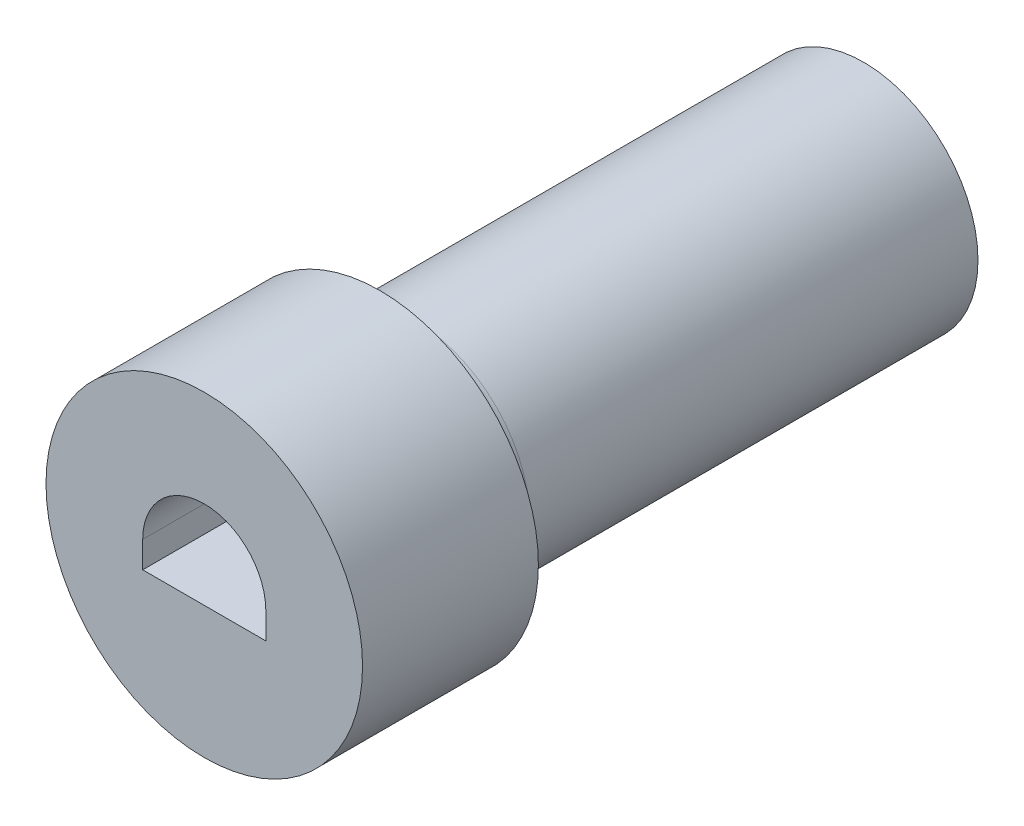
ISO-10303-21;
HEADER;
FILE_DESCRIPTION(('STEP AP214'),'2;1');
FILE_NAME('part.step','',(''),(''),'','','');
FILE_SCHEMA(('AUTOMOTIVE_DESIGN { 1 0 10303 214 1 1 1 1 }'));
ENDSEC;
DATA;
#1=APPLICATION_CONTEXT('core data for automotive mechanical design processes');
#2=APPLICATION_PROTOCOL_DEFINITION('international standard','automotive_design',2000,#1);
#3=PRODUCT_CONTEXT('',#1,'mechanical');
#4=PRODUCT('Part','Part','',(#3));
#5=PRODUCT_RELATED_PRODUCT_CATEGORY('part','',(#4));
#6=PRODUCT_DEFINITION_FORMATION('','',#4);
#7=PRODUCT_DEFINITION_CONTEXT('part definition',#1,'design');
#8=PRODUCT_DEFINITION('design','',#6,#7);
#9=PRODUCT_DEFINITION_SHAPE('','',#8);
#10=(LENGTH_UNIT() NAMED_UNIT(*) SI_UNIT(.MILLI.,.METRE.));
#11=(NAMED_UNIT(*) PLANE_ANGLE_UNIT() SI_UNIT($,.RADIAN.));
#12=(NAMED_UNIT(*) SI_UNIT($,.STERADIAN.) SOLID_ANGLE_UNIT());
#13=UNCERTAINTY_MEASURE_WITH_UNIT(LENGTH_MEASURE(1.E-05),#10,'distance_accuracy_value','');
#14=(GEOMETRIC_REPRESENTATION_CONTEXT(3) GLOBAL_UNCERTAINTY_ASSIGNED_CONTEXT((#13)) GLOBAL_UNIT_ASSIGNED_CONTEXT((#10,
#11,#12)) REPRESENTATION_CONTEXT('',''));
#15=CARTESIAN_POINT('',(0.,0.,0.));
#16=DIRECTION('',(0.,0.,1.));
#17=DIRECTION('',(1.,0.,0.));
#18=AXIS2_PLACEMENT_3D('',#15,#16,#17);
#19=CARTESIAN_POINT('',(0.,0.,6.985));
#20=DIRECTION('',(0.,0.,-1.));
#21=DIRECTION('',(-1.,0.,0.));
#22=AXIS2_PLACEMENT_3D('',#19,#20,#21);
#23=CYLINDRICAL_SURFACE('',#22,1.651);
#24=CARTESIAN_POINT('',(0.,0.,6.477));
#25=DIRECTION('',(0.,0.,1.));
#26=DIRECTION('',(1.,0.,0.));
#27=AXIS2_PLACEMENT_3D('',#24,#25,#26);
#28=CIRCLE('',#27,1.651);
#29=CARTESIAN_POINT('',(1.651,0.,6.477));
#30=VERTEX_POINT('',#29);
#31=EDGE_CURVE('E11',#30,#30,#28,.F.);
#32=ORIENTED_EDGE('',*,*,#31,.T.);
#33=EDGE_LOOP('',(#32));
#34=FACE_BOUND('',#33,.T.);
#35=CARTESIAN_POINT('',(0.,0.,0.));
#36=DIRECTION('',(0.,0.,1.));
#37=DIRECTION('',(1.,0.,0.));
#38=AXIS2_PLACEMENT_3D('',#35,#36,#37);
#39=CIRCLE('',#38,1.651);
#40=CARTESIAN_POINT('',(1.651,0.,0.));
#41=VERTEX_POINT('',#40);
#42=EDGE_CURVE('E119',#41,#41,#39,.T.);
#43=ORIENTED_EDGE('',*,*,#42,.T.);
#44=EDGE_LOOP('',(#43));
#45=FACE_BOUND('',#44,.T.);
#46=ADVANCED_FACE('F35',(#34,#45),#23,.T.);
#47=CARTESIAN_POINT('',(0.,0.,0.));
#48=DIRECTION('',(0.,0.,1.));
#49=DIRECTION('',(1.,0.,0.));
#50=AXIS2_PLACEMENT_3D('',#47,#48,#49);
#51=PLANE('',#50);
#52=ORIENTED_EDGE('',*,*,#42,.F.);
#53=EDGE_LOOP('',(#52));
#54=FACE_BOUND('',#53,.T.);
#55=ADVANCED_FACE('F139',(#54),#51,.F.);
#56=CARTESIAN_POINT('',(0.,0.,9.525));
#57=DIRECTION('',(0.,0.,-1.));
#58=DIRECTION('',(-1.,0.,0.));
#59=AXIS2_PLACEMENT_3D('',#56,#57,#58);
#60=CYLINDRICAL_SURFACE('',#59,2.286);
#61=CARTESIAN_POINT('',(0.,0.,9.525));
#62=DIRECTION('',(0.,0.,1.));
#63=DIRECTION('',(1.,0.,0.));
#64=AXIS2_PLACEMENT_3D('',#61,#62,#63);
#65=CIRCLE('',#64,2.286);
#66=CARTESIAN_POINT('',(2.286,0.,9.525));
#67=VERTEX_POINT('',#66);
#68=EDGE_CURVE('E116',#67,#67,#65,.T.);
#69=ORIENTED_EDGE('',*,*,#68,.F.);
#70=EDGE_LOOP('',(#69));
#71=FACE_BOUND('',#70,.T.);
#72=CARTESIAN_POINT('',(0.,0.,6.985));
#73=DIRECTION('',(0.,0.,1.));
#74=DIRECTION('',(1.,0.,0.));
#75=AXIS2_PLACEMENT_3D('',#72,#73,#74);
#76=CIRCLE('',#75,2.286);
#77=CARTESIAN_POINT('',(2.286,0.,6.985));
#78=VERTEX_POINT('',#77);
#79=EDGE_CURVE('E113',#78,#78,#76,.T.);
#80=ORIENTED_EDGE('',*,*,#79,.T.);
#81=EDGE_LOOP('',(#80));
#82=FACE_BOUND('',#81,.T.);
#83=ADVANCED_FACE('F144',(#71,#82),#60,.T.);
#84=CARTESIAN_POINT('',(0.,0.,9.525));
#85=DIRECTION('',(0.,0.,1.));
#86=DIRECTION('',(1.,0.,0.));
#87=AXIS2_PLACEMENT_3D('',#84,#85,#86);
#88=PLANE('',#87);
#89=CARTESIAN_POINT('',(0.,0.,9.525));
#90=DIRECTION('',(0.,0.,1.));
#91=DIRECTION('',(1.,0.,0.));
#92=AXIS2_PLACEMENT_3D('',#89,#90,#91);
#93=CIRCLE('',#92,0.889);
#94=CARTESIAN_POINT('',(0.889,0.,9.525));
#95=VERTEX_POINT('',#94);
#96=CARTESIAN_POINT('',(-0.889,0.,9.525));
#97=VERTEX_POINT('',#96);
#98=EDGE_CURVE('E50',#95,#97,#93,.T.);
#99=ORIENTED_EDGE('',*,*,#98,.F.);
#100=DIRECTION('',(0.,1.,0.));
#101=VECTOR('',#100,1.);
#102=CARTESIAN_POINT('',(0.889,0.,9.525));
#103=LINE('',#102,#101);
#104=CARTESIAN_POINT('',(0.889,-0.381,9.525));
#105=VERTEX_POINT('',#104);
#106=EDGE_CURVE('E98',#105,#95,#103,.T.);
#107=ORIENTED_EDGE('',*,*,#106,.F.);
#108=DIRECTION('',(1.,0.,0.));
#109=VECTOR('',#108,1.);
#110=CARTESIAN_POINT('',(-0.889,-0.381,9.525));
#111=LINE('',#110,#109);
#112=CARTESIAN_POINT('',(-0.889,-0.381,9.525));
#113=VERTEX_POINT('',#112);
#114=EDGE_CURVE('E82',#113,#105,#111,.T.);
#115=ORIENTED_EDGE('',*,*,#114,.F.);
#116=DIRECTION('',(0.,-1.,0.));
#117=VECTOR('',#116,1.);
#118=CARTESIAN_POINT('',(-0.889,0.,9.525));
#119=LINE('',#118,#117);
#120=EDGE_CURVE('E92',#97,#113,#119,.T.);
#121=ORIENTED_EDGE('',*,*,#120,.F.);
#122=EDGE_LOOP('',(#99,#107,#115,#121));
#123=FACE_BOUND('',#122,.T.);
#124=ORIENTED_EDGE('',*,*,#68,.T.);
#125=EDGE_LOOP('',(#124));
#126=FACE_BOUND('',#125,.T.);
#127=ADVANCED_FACE('F96',(#123,#126),#88,.T.);
#128=CARTESIAN_POINT('',(0.,0.,6.985));
#129=DIRECTION('',(0.,0.,1.));
#130=DIRECTION('',(1.,0.,0.));
#131=AXIS2_PLACEMENT_3D('',#128,#129,#130);
#132=PLANE('',#131);
#133=CARTESIAN_POINT('',(0.,0.,6.985));
#134=DIRECTION('',(0.,0.,1.));
#135=DIRECTION('',(1.,0.,0.));
#136=AXIS2_PLACEMENT_3D('',#133,#134,#135);
#137=CIRCLE('',#136,2.159);
#138=CARTESIAN_POINT('',(2.159,0.,6.985));
#139=VERTEX_POINT('',#138);
#140=EDGE_CURVE('E43',#139,#139,#137,.T.);
#141=ORIENTED_EDGE('',*,*,#140,.T.);
#142=EDGE_LOOP('',(#141));
#143=FACE_BOUND('',#142,.T.);
#144=ORIENTED_EDGE('',*,*,#79,.F.);
#145=EDGE_LOOP('',(#144));
#146=FACE_BOUND('',#145,.T.);
#147=ADVANCED_FACE('F126',(#143,#146),#132,.F.);
#148=CARTESIAN_POINT('',(0.,0.,4.445));
#149=DIRECTION('',(0.,0.,1.));
#150=DIRECTION('',(1.,0.,0.));
#151=AXIS2_PLACEMENT_3D('',#148,#149,#150);
#152=CYLINDRICAL_SURFACE('',#151,0.889);
#153=DIRECTION('',(0.,0.,1.));
#154=VECTOR('',#153,1.);
#155=CARTESIAN_POINT('',(-0.889,0.,4.445));
#156=LINE('',#155,#154);
#157=CARTESIAN_POINT('',(-0.889,0.,4.445));
#158=VERTEX_POINT('',#157);
#159=EDGE_CURVE('E89',#158,#97,#156,.T.);
#160=ORIENTED_EDGE('',*,*,#159,.F.);
#161=CARTESIAN_POINT('',(0.,0.,4.445));
#162=DIRECTION('',(0.,0.,1.));
#163=DIRECTION('',(1.,0.,0.));
#164=AXIS2_PLACEMENT_3D('',#161,#162,#163);
#165=CIRCLE('',#164,0.889);
#166=CARTESIAN_POINT('',(0.889,0.,4.445));
#167=VERTEX_POINT('',#166);
#168=EDGE_CURVE('E100',#167,#158,#165,.T.);
#169=ORIENTED_EDGE('',*,*,#168,.F.);
#170=DIRECTION('',(0.,0.,1.));
#171=VECTOR('',#170,1.);
#172=CARTESIAN_POINT('',(0.889,0.,4.445));
#173=LINE('',#172,#171);
#174=EDGE_CURVE('E57',#167,#95,#173,.T.);
#175=ORIENTED_EDGE('',*,*,#174,.T.);
#176=ORIENTED_EDGE('',*,*,#98,.T.);
#177=EDGE_LOOP('',(#160,#169,#175,#176));
#178=FACE_BOUND('',#177,.T.);
#179=ADVANCED_FACE('F154',(#178),#152,.F.);
#180=CARTESIAN_POINT('',(0.889,0.,4.445));
#181=DIRECTION('',(1.,0.,0.));
#182=DIRECTION('',(0.,0.,-1.));
#183=AXIS2_PLACEMENT_3D('',#180,#181,#182);
#184=PLANE('',#183);
#185=ORIENTED_EDGE('',*,*,#174,.F.);
#186=DIRECTION('',(0.,1.,0.));
#187=VECTOR('',#186,1.);
#188=CARTESIAN_POINT('',(0.889,0.,4.445));
#189=LINE('',#188,#187);
#190=CARTESIAN_POINT('',(0.889,-0.381,4.445));
#191=VERTEX_POINT('',#190);
#192=EDGE_CURVE('E109',#191,#167,#189,.T.);
#193=ORIENTED_EDGE('',*,*,#192,.F.);
#194=DIRECTION('',(0.,0.,1.));
#195=VECTOR('',#194,1.);
#196=CARTESIAN_POINT('',(0.889,-0.381,4.445));
#197=LINE('',#196,#195);
#198=EDGE_CURVE('E88',#191,#105,#197,.T.);
#199=ORIENTED_EDGE('',*,*,#198,.T.);
#200=ORIENTED_EDGE('',*,*,#106,.T.);
#201=EDGE_LOOP('',(#185,#193,#199,#200));
#202=FACE_BOUND('',#201,.T.);
#203=ADVANCED_FACE('F159',(#202),#184,.F.);
#204=CARTESIAN_POINT('',(0.889,-0.381,4.445));
#205=DIRECTION('',(0.,-1.,0.));
#206=DIRECTION('',(1.,0.,0.));
#207=AXIS2_PLACEMENT_3D('',#204,#205,#206);
#208=PLANE('',#207);
#209=ORIENTED_EDGE('',*,*,#198,.F.);
#210=DIRECTION('',(1.,0.,0.));
#211=VECTOR('',#210,1.);
#212=CARTESIAN_POINT('',(-0.889,-0.381,4.445));
#213=LINE('',#212,#211);
#214=CARTESIAN_POINT('',(-0.889,-0.381,4.445));
#215=VERTEX_POINT('',#214);
#216=EDGE_CURVE('E84',#215,#191,#213,.T.);
#217=ORIENTED_EDGE('',*,*,#216,.F.);
#218=DIRECTION('',(0.,0.,1.));
#219=VECTOR('',#218,1.);
#220=CARTESIAN_POINT('',(-0.889,-0.381,4.445));
#221=LINE('',#220,#219);
#222=EDGE_CURVE('E77',#215,#113,#221,.T.);
#223=ORIENTED_EDGE('',*,*,#222,.T.);
#224=ORIENTED_EDGE('',*,*,#114,.T.);
#225=EDGE_LOOP('',(#209,#217,#223,#224));
#226=FACE_BOUND('',#225,.T.);
#227=ADVANCED_FACE('F80',(#226),#208,.F.);
#228=CARTESIAN_POINT('',(-0.889,0.,4.445));
#229=DIRECTION('',(-1.,0.,0.));
#230=DIRECTION('',(0.,0.,1.));
#231=AXIS2_PLACEMENT_3D('',#228,#229,#230);
#232=PLANE('',#231);
#233=ORIENTED_EDGE('',*,*,#222,.F.);
#234=DIRECTION('',(0.,-1.,0.));
#235=VECTOR('',#234,1.);
#236=CARTESIAN_POINT('',(-0.889,0.,4.445));
#237=LINE('',#236,#235);
#238=EDGE_CURVE('E106',#158,#215,#237,.T.);
#239=ORIENTED_EDGE('',*,*,#238,.F.);
#240=ORIENTED_EDGE('',*,*,#159,.T.);
#241=ORIENTED_EDGE('',*,*,#120,.T.);
#242=EDGE_LOOP('',(#233,#239,#240,#241));
#243=FACE_BOUND('',#242,.T.);
#244=ADVANCED_FACE('F93',(#243),#232,.F.);
#245=CARTESIAN_POINT('',(0.,0.,4.445));
#246=DIRECTION('',(0.,0.,1.));
#247=DIRECTION('',(1.,0.,0.));
#248=AXIS2_PLACEMENT_3D('',#245,#246,#247);
#249=PLANE('',#248);
#250=ORIENTED_EDGE('',*,*,#168,.T.);
#251=ORIENTED_EDGE('',*,*,#238,.T.);
#252=ORIENTED_EDGE('',*,*,#216,.T.);
#253=ORIENTED_EDGE('',*,*,#192,.T.);
#254=EDGE_LOOP('',(#250,#251,#252,#253));
#255=FACE_BOUND('',#254,.T.);
#256=ADVANCED_FACE('F130',(#255),#249,.T.);
#257=CARTESIAN_POINT('',(0.,0.,6.477));
#258=DIRECTION('',(0.,0.,1.));
#259=DIRECTION('',(1.,0.,0.));
#260=AXIS2_PLACEMENT_3D('',#257,#258,#259);
#261=TOROIDAL_SURFACE('',#260,2.159,0.508);
#262=ORIENTED_EDGE('',*,*,#31,.F.);
#263=EDGE_LOOP('',(#262));
#264=FACE_BOUND('',#263,.T.);
#265=ORIENTED_EDGE('',*,*,#140,.F.);
#266=EDGE_LOOP('',(#265));
#267=FACE_BOUND('',#266,.T.);
#268=ADVANCED_FACE('F37',(#264,#267),#261,.F.);
#269=CLOSED_SHELL('',(#46,#55,#83,#127,#147,#179,#203,#227,#244,#256,#268));
#270=MANIFOLD_SOLID_BREP('B2',#269);
#271=ADVANCED_BREP_SHAPE_REPRESENTATION('',(#18,#270),#14);
#272=SHAPE_DEFINITION_REPRESENTATION(#9,#271);
ENDSEC;
END-ISO-10303-21;
